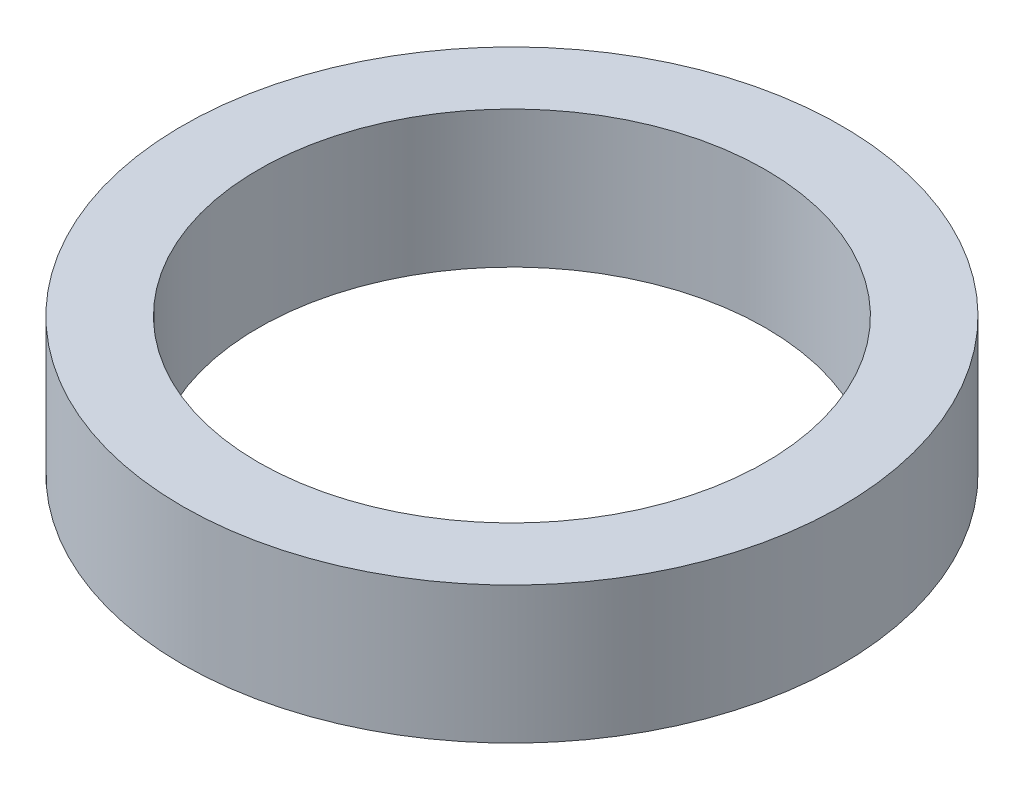
ISO-10303-21;
HEADER;
FILE_DESCRIPTION(('STEP AP214'),'2;1');
FILE_NAME('part.step','',(''),(''),'','','');
FILE_SCHEMA(('AUTOMOTIVE_DESIGN { 1 0 10303 214 1 1 1 1 }'));
ENDSEC;
DATA;
#1=APPLICATION_CONTEXT('core data for automotive mechanical design processes');
#2=APPLICATION_PROTOCOL_DEFINITION('international standard','automotive_design',2000,#1);
#3=PRODUCT_CONTEXT('',#1,'mechanical');
#4=PRODUCT('Part','Part','',(#3));
#5=PRODUCT_RELATED_PRODUCT_CATEGORY('part','',(#4));
#6=PRODUCT_DEFINITION_FORMATION('','',#4);
#7=PRODUCT_DEFINITION_CONTEXT('part definition',#1,'design');
#8=PRODUCT_DEFINITION('design','',#6,#7);
#9=PRODUCT_DEFINITION_SHAPE('','',#8);
#10=(LENGTH_UNIT() NAMED_UNIT(*) SI_UNIT(.MILLI.,.METRE.));
#11=(NAMED_UNIT(*) PLANE_ANGLE_UNIT() SI_UNIT($,.RADIAN.));
#12=(NAMED_UNIT(*) SI_UNIT($,.STERADIAN.) SOLID_ANGLE_UNIT());
#13=UNCERTAINTY_MEASURE_WITH_UNIT(LENGTH_MEASURE(1.E-05),#10,'distance_accuracy_value','');
#14=(GEOMETRIC_REPRESENTATION_CONTEXT(3) GLOBAL_UNCERTAINTY_ASSIGNED_CONTEXT((#13)) GLOBAL_UNIT_ASSIGNED_CONTEXT((#10,
#11,#12)) REPRESENTATION_CONTEXT('',''));
#15=CARTESIAN_POINT('',(0.,0.,0.));
#16=DIRECTION('',(0.,0.,1.));
#17=DIRECTION('',(1.,0.,0.));
#18=AXIS2_PLACEMENT_3D('',#15,#16,#17);
#19=CARTESIAN_POINT('',(0.,27.,0.));
#20=DIRECTION('',(0.,-1.,0.));
#21=DIRECTION('',(0.,0.,-1.));
#22=AXIS2_PLACEMENT_3D('',#19,#20,#21);
#23=CYLINDRICAL_SURFACE('',#22,65.);
#24=CARTESIAN_POINT('',(0.,27.,0.));
#25=DIRECTION('',(0.,1.,0.));
#26=DIRECTION('',(0.,0.,1.));
#27=AXIS2_PLACEMENT_3D('',#24,#25,#26);
#28=CIRCLE('',#27,65.);
#29=CARTESIAN_POINT('',(0.,27.,65.));
#30=VERTEX_POINT('',#29);
#31=EDGE_CURVE('E10',#30,#30,#28,.T.);
#32=ORIENTED_EDGE('',*,*,#31,.F.);
#33=EDGE_LOOP('',(#32));
#34=FACE_BOUND('',#33,.T.);
#35=CARTESIAN_POINT('',(0.,0.,0.));
#36=DIRECTION('',(0.,1.,0.));
#37=DIRECTION('',(0.,0.,1.));
#38=AXIS2_PLACEMENT_3D('',#35,#36,#37);
#39=CIRCLE('',#38,65.);
#40=CARTESIAN_POINT('',(0.,0.,65.));
#41=VERTEX_POINT('',#40);
#42=EDGE_CURVE('E37',#41,#41,#39,.T.);
#43=ORIENTED_EDGE('',*,*,#42,.T.);
#44=EDGE_LOOP('',(#43));
#45=FACE_BOUND('',#44,.T.);
#46=ADVANCED_FACE('F40',(#34,#45),#23,.T.);
#47=CARTESIAN_POINT('',(0.,27.,0.));
#48=DIRECTION('',(0.,1.,0.));
#49=DIRECTION('',(0.,0.,1.));
#50=AXIS2_PLACEMENT_3D('',#47,#48,#49);
#51=PLANE('',#50);
#52=CARTESIAN_POINT('',(0.,27.,0.));
#53=DIRECTION('',(0.,1.,0.));
#54=DIRECTION('',(0.,0.,1.));
#55=AXIS2_PLACEMENT_3D('',#52,#53,#54);
#56=CIRCLE('',#55,50.);
#57=CARTESIAN_POINT('',(0.,27.,50.));
#58=VERTEX_POINT('',#57);
#59=EDGE_CURVE('E50',#58,#58,#56,.T.);
#60=ORIENTED_EDGE('',*,*,#59,.F.);
#61=EDGE_LOOP('',(#60));
#62=FACE_BOUND('',#61,.T.);
#63=ORIENTED_EDGE('',*,*,#31,.T.);
#64=EDGE_LOOP('',(#63));
#65=FACE_BOUND('',#64,.T.);
#66=ADVANCED_FACE('F59',(#62,#65),#51,.T.);
#67=CARTESIAN_POINT('',(0.,0.,0.));
#68=DIRECTION('',(0.,1.,0.));
#69=DIRECTION('',(0.,0.,1.));
#70=AXIS2_PLACEMENT_3D('',#67,#68,#69);
#71=PLANE('',#70);
#72=CARTESIAN_POINT('',(0.,0.,0.));
#73=DIRECTION('',(0.,1.,0.));
#74=DIRECTION('',(0.,0.,1.));
#75=AXIS2_PLACEMENT_3D('',#72,#73,#74);
#76=CIRCLE('',#75,50.);
#77=CARTESIAN_POINT('',(0.,0.,50.));
#78=VERTEX_POINT('',#77);
#79=EDGE_CURVE('E47',#78,#78,#76,.T.);
#80=ORIENTED_EDGE('',*,*,#79,.T.);
#81=EDGE_LOOP('',(#80));
#82=FACE_BOUND('',#81,.T.);
#83=ORIENTED_EDGE('',*,*,#42,.F.);
#84=EDGE_LOOP('',(#83));
#85=FACE_BOUND('',#84,.T.);
#86=ADVANCED_FACE('F58',(#82,#85),#71,.F.);
#87=CARTESIAN_POINT('',(0.,27.,0.));
#88=DIRECTION('',(0.,-1.,0.));
#89=DIRECTION('',(0.,0.,-1.));
#90=AXIS2_PLACEMENT_3D('',#87,#88,#89);
#91=CYLINDRICAL_SURFACE('',#90,50.);
#92=ORIENTED_EDGE('',*,*,#59,.T.);
#93=EDGE_LOOP('',(#92));
#94=FACE_BOUND('',#93,.T.);
#95=ORIENTED_EDGE('',*,*,#79,.F.);
#96=EDGE_LOOP('',(#95));
#97=FACE_BOUND('',#96,.T.);
#98=ADVANCED_FACE('F54',(#94,#97),#91,.F.);
#99=CLOSED_SHELL('',(#46,#66,#86,#98));
#100=MANIFOLD_SOLID_BREP('B2',#99);
#101=ADVANCED_BREP_SHAPE_REPRESENTATION('',(#18,#100),#14);
#102=SHAPE_DEFINITION_REPRESENTATION(#9,#101);
ENDSEC;
END-ISO-10303-21;
